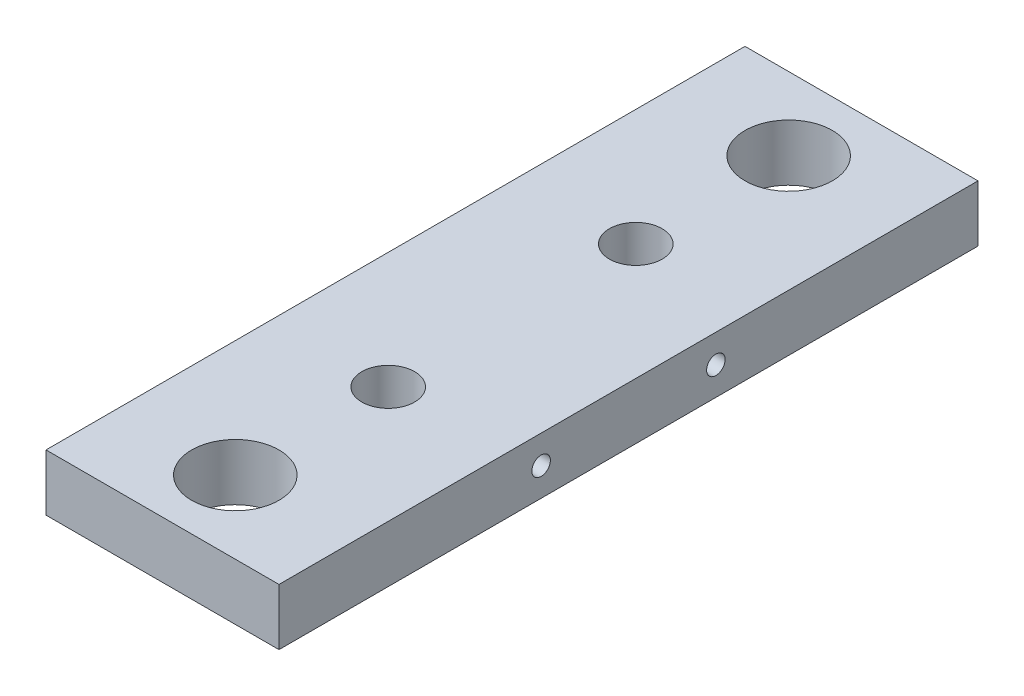
ISO-10303-21;
HEADER;
FILE_DESCRIPTION(('STEP AP214'),'2;1');
FILE_NAME('part.step','',(''),(''),'','','');
FILE_SCHEMA(('AUTOMOTIVE_DESIGN { 1 0 10303 214 1 1 1 1 }'));
ENDSEC;
DATA;
#1=APPLICATION_CONTEXT('core data for automotive mechanical design processes');
#2=APPLICATION_PROTOCOL_DEFINITION('international standard','automotive_design',2000,#1);
#3=PRODUCT_CONTEXT('',#1,'mechanical');
#4=PRODUCT('Part','Part','',(#3));
#5=PRODUCT_RELATED_PRODUCT_CATEGORY('part','',(#4));
#6=PRODUCT_DEFINITION_FORMATION('','',#4);
#7=PRODUCT_DEFINITION_CONTEXT('part definition',#1,'design');
#8=PRODUCT_DEFINITION('design','',#6,#7);
#9=PRODUCT_DEFINITION_SHAPE('','',#8);
#10=(LENGTH_UNIT() NAMED_UNIT(*) SI_UNIT(.MILLI.,.METRE.));
#11=(NAMED_UNIT(*) PLANE_ANGLE_UNIT() SI_UNIT($,.RADIAN.));
#12=(NAMED_UNIT(*) SI_UNIT($,.STERADIAN.) SOLID_ANGLE_UNIT());
#13=UNCERTAINTY_MEASURE_WITH_UNIT(LENGTH_MEASURE(1.E-05),#10,'distance_accuracy_value','');
#14=(GEOMETRIC_REPRESENTATION_CONTEXT(3) GLOBAL_UNCERTAINTY_ASSIGNED_CONTEXT((#13)) GLOBAL_UNIT_ASSIGNED_CONTEXT((#10,
#11,#12)) REPRESENTATION_CONTEXT('',''));
#15=CARTESIAN_POINT('',(0.,0.,0.));
#16=DIRECTION('',(0.,0.,1.));
#17=DIRECTION('',(1.,0.,0.));
#18=AXIS2_PLACEMENT_3D('',#15,#16,#17);
#19=CARTESIAN_POINT('',(-25.4,6.1595,-76.2));
#20=DIRECTION('',(1.,0.,0.));
#21=DIRECTION('',(0.,0.,-1.));
#22=AXIS2_PLACEMENT_3D('',#19,#20,#21);
#23=PLANE('',#22);
#24=CARTESIAN_POINT('',(-25.4,0.,19.05));
#25=DIRECTION('',(-1.,0.,0.));
#26=DIRECTION('',(0.,0.,1.));
#27=AXIS2_PLACEMENT_3D('',#24,#25,#26);
#28=CIRCLE('',#27,2.01929999999999);
#29=CARTESIAN_POINT('',(-25.4,0.,21.0693));
#30=VERTEX_POINT('',#29);
#31=EDGE_CURVE('E107',#30,#30,#28,.T.);
#32=ORIENTED_EDGE('',*,*,#31,.F.);
#33=EDGE_LOOP('',(#32));
#34=FACE_BOUND('',#33,.T.);
#35=CARTESIAN_POINT('',(-25.4,0.,-19.05));
#36=DIRECTION('',(-1.,0.,0.));
#37=DIRECTION('',(0.,0.,1.));
#38=AXIS2_PLACEMENT_3D('',#35,#36,#37);
#39=CIRCLE('',#38,2.01929999999999);
#40=CARTESIAN_POINT('',(-25.4,0.,-17.0307));
#41=VERTEX_POINT('',#40);
#42=EDGE_CURVE('E106',#41,#41,#39,.T.);
#43=ORIENTED_EDGE('',*,*,#42,.F.);
#44=EDGE_LOOP('',(#43));
#45=FACE_BOUND('',#44,.T.);
#46=DIRECTION('',(0.,0.,1.));
#47=VECTOR('',#46,1.);
#48=CARTESIAN_POINT('',(-25.4,-6.1595,-76.2));
#49=LINE('',#48,#47);
#50=CARTESIAN_POINT('',(-25.4,-6.1595,-76.2));
#51=VERTEX_POINT('',#50);
#52=CARTESIAN_POINT('',(-25.4,-6.1595,76.2));
#53=VERTEX_POINT('',#52);
#54=EDGE_CURVE('E153',#51,#53,#49,.T.);
#55=ORIENTED_EDGE('',*,*,#54,.T.);
#56=DIRECTION('',(0.,-1.,0.));
#57=VECTOR('',#56,1.);
#58=CARTESIAN_POINT('',(-25.4,6.1595,76.2));
#59=LINE('',#58,#57);
#60=CARTESIAN_POINT('',(-25.4,6.1595,76.2));
#61=VERTEX_POINT('',#60);
#62=EDGE_CURVE('E11',#61,#53,#59,.T.);
#63=ORIENTED_EDGE('',*,*,#62,.F.);
#64=DIRECTION('',(0.,0.,1.));
#65=VECTOR('',#64,1.);
#66=CARTESIAN_POINT('',(-25.4,6.1595,-76.2));
#67=LINE('',#66,#65);
#68=CARTESIAN_POINT('',(-25.4,6.1595,-76.2));
#69=VERTEX_POINT('',#68);
#70=EDGE_CURVE('E154',#69,#61,#67,.T.);
#71=ORIENTED_EDGE('',*,*,#70,.F.);
#72=DIRECTION('',(0.,-1.,0.));
#73=VECTOR('',#72,1.);
#74=CARTESIAN_POINT('',(-25.4,6.1595,-76.2));
#75=LINE('',#74,#73);
#76=EDGE_CURVE('E160',#69,#51,#75,.T.);
#77=ORIENTED_EDGE('',*,*,#76,.T.);
#78=EDGE_LOOP('',(#55,#63,#71,#77));
#79=FACE_BOUND('',#78,.T.);
#80=ADVANCED_FACE('F36',(#34,#45,#79),#23,.F.);
#81=CARTESIAN_POINT('',(-25.4,6.1595,76.2));
#82=DIRECTION('',(0.,0.,-1.));
#83=DIRECTION('',(-1.,0.,0.));
#84=AXIS2_PLACEMENT_3D('',#81,#82,#83);
#85=PLANE('',#84);
#86=DIRECTION('',(1.,0.,0.));
#87=VECTOR('',#86,1.);
#88=CARTESIAN_POINT('',(-25.4,-6.1595,76.2));
#89=LINE('',#88,#87);
#90=CARTESIAN_POINT('',(25.4,-6.1595,76.2));
#91=VERTEX_POINT('',#90);
#92=EDGE_CURVE('E163',#53,#91,#89,.T.);
#93=ORIENTED_EDGE('',*,*,#92,.T.);
#94=DIRECTION('',(0.,-1.,0.));
#95=VECTOR('',#94,1.);
#96=CARTESIAN_POINT('',(25.4,6.1595,76.2));
#97=LINE('',#96,#95);
#98=CARTESIAN_POINT('',(25.4,6.1595,76.2));
#99=VERTEX_POINT('',#98);
#100=EDGE_CURVE('E44',#99,#91,#97,.T.);
#101=ORIENTED_EDGE('',*,*,#100,.F.);
#102=DIRECTION('',(1.,0.,0.));
#103=VECTOR('',#102,1.);
#104=CARTESIAN_POINT('',(-25.4,6.1595,76.2));
#105=LINE('',#104,#103);
#106=EDGE_CURVE('E83',#61,#99,#105,.T.);
#107=ORIENTED_EDGE('',*,*,#106,.F.);
#108=ORIENTED_EDGE('',*,*,#62,.T.);
#109=EDGE_LOOP('',(#93,#101,#107,#108));
#110=FACE_BOUND('',#109,.T.);
#111=ADVANCED_FACE('F187',(#110),#85,.F.);
#112=CARTESIAN_POINT('',(25.4,6.1595,-76.2));
#113=DIRECTION('',(-1.,0.,0.));
#114=DIRECTION('',(0.,0.,1.));
#115=AXIS2_PLACEMENT_3D('',#112,#113,#114);
#116=PLANE('',#115);
#117=CARTESIAN_POINT('',(25.4,0.,19.05));
#118=DIRECTION('',(1.,0.,0.));
#119=DIRECTION('',(0.,0.,-1.));
#120=AXIS2_PLACEMENT_3D('',#117,#118,#119);
#121=CIRCLE('',#120,2.01929999999999);
#122=CARTESIAN_POINT('',(25.4,0.,17.0307));
#123=VERTEX_POINT('',#122);
#124=EDGE_CURVE('E117',#123,#123,#121,.T.);
#125=ORIENTED_EDGE('',*,*,#124,.F.);
#126=EDGE_LOOP('',(#125));
#127=FACE_BOUND('',#126,.T.);
#128=CARTESIAN_POINT('',(25.4,0.,-19.05));
#129=DIRECTION('',(1.,0.,0.));
#130=DIRECTION('',(0.,0.,-1.));
#131=AXIS2_PLACEMENT_3D('',#128,#129,#130);
#132=CIRCLE('',#131,2.01929999999999);
#133=CARTESIAN_POINT('',(25.4,0.,-21.0693));
#134=VERTEX_POINT('',#133);
#135=EDGE_CURVE('E123',#134,#134,#132,.T.);
#136=ORIENTED_EDGE('',*,*,#135,.F.);
#137=EDGE_LOOP('',(#136));
#138=FACE_BOUND('',#137,.T.);
#139=DIRECTION('',(0.,0.,-1.));
#140=VECTOR('',#139,1.);
#141=CARTESIAN_POINT('',(25.4,-6.1595,-76.2));
#142=LINE('',#141,#140);
#143=CARTESIAN_POINT('',(25.4,-6.1595,-76.2));
#144=VERTEX_POINT('',#143);
#145=EDGE_CURVE('E70',#91,#144,#142,.T.);
#146=ORIENTED_EDGE('',*,*,#145,.T.);
#147=DIRECTION('',(0.,-1.,0.));
#148=VECTOR('',#147,1.);
#149=CARTESIAN_POINT('',(25.4,6.1595,-76.2));
#150=LINE('',#149,#148);
#151=CARTESIAN_POINT('',(25.4,6.1595,-76.2));
#152=VERTEX_POINT('',#151);
#153=EDGE_CURVE('E168',#152,#144,#150,.T.);
#154=ORIENTED_EDGE('',*,*,#153,.F.);
#155=DIRECTION('',(0.,0.,-1.));
#156=VECTOR('',#155,1.);
#157=CARTESIAN_POINT('',(25.4,6.1595,-76.2));
#158=LINE('',#157,#156);
#159=EDGE_CURVE('E157',#99,#152,#158,.T.);
#160=ORIENTED_EDGE('',*,*,#159,.F.);
#161=ORIENTED_EDGE('',*,*,#100,.T.);
#162=EDGE_LOOP('',(#146,#154,#160,#161));
#163=FACE_BOUND('',#162,.T.);
#164=ADVANCED_FACE('F170',(#127,#138,#163),#116,.F.);
#165=CARTESIAN_POINT('',(-25.4,6.1595,-76.2));
#166=DIRECTION('',(0.,0.,1.));
#167=DIRECTION('',(1.,0.,0.));
#168=AXIS2_PLACEMENT_3D('',#165,#166,#167);
#169=PLANE('',#168);
#170=DIRECTION('',(-1.,0.,0.));
#171=VECTOR('',#170,1.);
#172=CARTESIAN_POINT('',(-25.4,-6.1595,-76.2));
#173=LINE('',#172,#171);
#174=EDGE_CURVE('E76',#144,#51,#173,.T.);
#175=ORIENTED_EDGE('',*,*,#174,.T.);
#176=ORIENTED_EDGE('',*,*,#76,.F.);
#177=DIRECTION('',(-1.,0.,0.));
#178=VECTOR('',#177,1.);
#179=CARTESIAN_POINT('',(-25.4,6.1595,-76.2));
#180=LINE('',#179,#178);
#181=EDGE_CURVE('E52',#152,#69,#180,.T.);
#182=ORIENTED_EDGE('',*,*,#181,.F.);
#183=ORIENTED_EDGE('',*,*,#153,.T.);
#184=EDGE_LOOP('',(#175,#176,#182,#183));
#185=FACE_BOUND('',#184,.T.);
#186=ADVANCED_FACE('F177',(#185),#169,.F.);
#187=CARTESIAN_POINT('',(-25.4,6.1595,76.2));
#188=DIRECTION('',(0.,1.,0.));
#189=DIRECTION('',(0.,0.,1.));
#190=AXIS2_PLACEMENT_3D('',#187,#188,#189);
#191=PLANE('',#190);
#192=CARTESIAN_POINT('',(0.,6.1595,-26.9875));
#193=DIRECTION('',(0.,1.,0.));
#194=DIRECTION('',(0.,0.,1.));
#195=AXIS2_PLACEMENT_3D('',#192,#193,#194);
#196=CIRCLE('',#195,5.75437);
#197=CARTESIAN_POINT('',(0.,6.1595,-21.23313));
#198=VERTEX_POINT('',#197);
#199=EDGE_CURVE('E129',#198,#198,#196,.T.);
#200=ORIENTED_EDGE('',*,*,#199,.F.);
#201=EDGE_LOOP('',(#200));
#202=FACE_BOUND('',#201,.T.);
#203=CARTESIAN_POINT('',(0.,6.1595,26.9875));
#204=DIRECTION('',(0.,1.,0.));
#205=DIRECTION('',(0.,0.,1.));
#206=AXIS2_PLACEMENT_3D('',#203,#204,#205);
#207=CIRCLE('',#206,5.75437);
#208=CARTESIAN_POINT('',(0.,6.1595,32.74187));
#209=VERTEX_POINT('',#208);
#210=EDGE_CURVE('E135',#209,#209,#207,.T.);
#211=ORIENTED_EDGE('',*,*,#210,.F.);
#212=EDGE_LOOP('',(#211));
#213=FACE_BOUND('',#212,.T.);
#214=CARTESIAN_POINT('',(0.,6.1595,60.325));
#215=DIRECTION('',(0.,1.,0.));
#216=DIRECTION('',(0.,0.,1.));
#217=AXIS2_PLACEMENT_3D('',#214,#215,#216);
#218=CIRCLE('',#217,9.52500000000002);
#219=CARTESIAN_POINT('',(0.,6.1595,69.85));
#220=VERTEX_POINT('',#219);
#221=EDGE_CURVE('E141',#220,#220,#218,.T.);
#222=ORIENTED_EDGE('',*,*,#221,.F.);
#223=EDGE_LOOP('',(#222));
#224=FACE_BOUND('',#223,.T.);
#225=CARTESIAN_POINT('',(0.,6.1595,-60.325));
#226=DIRECTION('',(0.,1.,0.));
#227=DIRECTION('',(0.,0.,1.));
#228=AXIS2_PLACEMENT_3D('',#225,#226,#227);
#229=CIRCLE('',#228,9.52500000000002);
#230=CARTESIAN_POINT('',(0.,6.1595,-50.8));
#231=VERTEX_POINT('',#230);
#232=EDGE_CURVE('E147',#231,#231,#229,.T.);
#233=ORIENTED_EDGE('',*,*,#232,.F.);
#234=EDGE_LOOP('',(#233));
#235=FACE_BOUND('',#234,.T.);
#236=ORIENTED_EDGE('',*,*,#70,.T.);
#237=ORIENTED_EDGE('',*,*,#106,.T.);
#238=ORIENTED_EDGE('',*,*,#159,.T.);
#239=ORIENTED_EDGE('',*,*,#181,.T.);
#240=EDGE_LOOP('',(#236,#237,#238,#239));
#241=FACE_BOUND('',#240,.T.);
#242=ADVANCED_FACE('F179',(#202,#213,#224,#235,#241),#191,.T.);
#243=CARTESIAN_POINT('',(-25.4,-6.1595,76.2));
#244=DIRECTION('',(0.,1.,0.));
#245=DIRECTION('',(0.,0.,1.));
#246=AXIS2_PLACEMENT_3D('',#243,#244,#245);
#247=PLANE('',#246);
#248=CARTESIAN_POINT('',(0.,-6.1595,-26.9875));
#249=DIRECTION('',(0.,1.,0.));
#250=DIRECTION('',(0.,0.,1.));
#251=AXIS2_PLACEMENT_3D('',#248,#249,#250);
#252=CIRCLE('',#251,5.75437);
#253=CARTESIAN_POINT('',(0.,-6.1595,-21.23313));
#254=VERTEX_POINT('',#253);
#255=EDGE_CURVE('E132',#254,#254,#252,.T.);
#256=ORIENTED_EDGE('',*,*,#255,.T.);
#257=EDGE_LOOP('',(#256));
#258=FACE_BOUND('',#257,.T.);
#259=CARTESIAN_POINT('',(0.,-6.1595,26.9875));
#260=DIRECTION('',(0.,1.,0.));
#261=DIRECTION('',(0.,0.,1.));
#262=AXIS2_PLACEMENT_3D('',#259,#260,#261);
#263=CIRCLE('',#262,5.75437);
#264=CARTESIAN_POINT('',(0.,-6.1595,32.74187));
#265=VERTEX_POINT('',#264);
#266=EDGE_CURVE('E138',#265,#265,#263,.T.);
#267=ORIENTED_EDGE('',*,*,#266,.T.);
#268=EDGE_LOOP('',(#267));
#269=FACE_BOUND('',#268,.T.);
#270=CARTESIAN_POINT('',(0.,-6.1595,60.325));
#271=DIRECTION('',(0.,1.,0.));
#272=DIRECTION('',(0.,0.,1.));
#273=AXIS2_PLACEMENT_3D('',#270,#271,#272);
#274=CIRCLE('',#273,9.52500000000002);
#275=CARTESIAN_POINT('',(0.,-6.1595,69.85));
#276=VERTEX_POINT('',#275);
#277=EDGE_CURVE('E144',#276,#276,#274,.F.);
#278=ORIENTED_EDGE('',*,*,#277,.F.);
#279=EDGE_LOOP('',(#278));
#280=FACE_BOUND('',#279,.T.);
#281=CARTESIAN_POINT('',(0.,-6.1595,-60.325));
#282=DIRECTION('',(0.,1.,0.));
#283=DIRECTION('',(0.,0.,1.));
#284=AXIS2_PLACEMENT_3D('',#281,#282,#283);
#285=CIRCLE('',#284,9.52500000000002);
#286=CARTESIAN_POINT('',(0.,-6.1595,-50.8));
#287=VERTEX_POINT('',#286);
#288=EDGE_CURVE('E150',#287,#287,#285,.F.);
#289=ORIENTED_EDGE('',*,*,#288,.F.);
#290=EDGE_LOOP('',(#289));
#291=FACE_BOUND('',#290,.T.);
#292=ORIENTED_EDGE('',*,*,#54,.F.);
#293=ORIENTED_EDGE('',*,*,#174,.F.);
#294=ORIENTED_EDGE('',*,*,#145,.F.);
#295=ORIENTED_EDGE('',*,*,#92,.F.);
#296=EDGE_LOOP('',(#292,#293,#294,#295));
#297=FACE_BOUND('',#296,.T.);
#298=ADVANCED_FACE('F173',(#258,#269,#280,#291,#297),#247,.F.);
#299=CARTESIAN_POINT('',(0.,-6.1605,-60.325));
#300=DIRECTION('',(0.,1.,0.));
#301=DIRECTION('',(0.,0.,1.));
#302=AXIS2_PLACEMENT_3D('',#299,#300,#301);
#303=CYLINDRICAL_SURFACE('',#302,9.52500000000002);
#304=ORIENTED_EDGE('',*,*,#232,.T.);
#305=EDGE_LOOP('',(#304));
#306=FACE_BOUND('',#305,.T.);
#307=ORIENTED_EDGE('',*,*,#288,.T.);
#308=EDGE_LOOP('',(#307));
#309=FACE_BOUND('',#308,.T.);
#310=ADVANCED_FACE('F239',(#306,#309),#303,.F.);
#311=CARTESIAN_POINT('',(0.,-6.1605,60.325));
#312=DIRECTION('',(0.,1.,0.));
#313=DIRECTION('',(0.,0.,1.));
#314=AXIS2_PLACEMENT_3D('',#311,#312,#313);
#315=CYLINDRICAL_SURFACE('',#314,9.52500000000002);
#316=ORIENTED_EDGE('',*,*,#221,.T.);
#317=EDGE_LOOP('',(#316));
#318=FACE_BOUND('',#317,.T.);
#319=ORIENTED_EDGE('',*,*,#277,.T.);
#320=EDGE_LOOP('',(#319));
#321=FACE_BOUND('',#320,.T.);
#322=ADVANCED_FACE('F235',(#318,#321),#315,.F.);
#323=CARTESIAN_POINT('',(0.,6.1595,26.9875));
#324=DIRECTION('',(0.,1.,0.));
#325=DIRECTION('',(0.,0.,1.));
#326=AXIS2_PLACEMENT_3D('',#323,#324,#325);
#327=CYLINDRICAL_SURFACE('',#326,5.75437);
#328=ORIENTED_EDGE('',*,*,#266,.F.);
#329=EDGE_LOOP('',(#328));
#330=FACE_BOUND('',#329,.T.);
#331=ORIENTED_EDGE('',*,*,#210,.T.);
#332=EDGE_LOOP('',(#331));
#333=FACE_BOUND('',#332,.T.);
#334=ADVANCED_FACE('F231',(#330,#333),#327,.F.);
#335=CARTESIAN_POINT('',(0.,6.1595,-26.9875));
#336=DIRECTION('',(0.,1.,0.));
#337=DIRECTION('',(0.,0.,1.));
#338=AXIS2_PLACEMENT_3D('',#335,#336,#337);
#339=CYLINDRICAL_SURFACE('',#338,5.75437);
#340=ORIENTED_EDGE('',*,*,#255,.F.);
#341=EDGE_LOOP('',(#340));
#342=FACE_BOUND('',#341,.T.);
#343=ORIENTED_EDGE('',*,*,#199,.T.);
#344=EDGE_LOOP('',(#343));
#345=FACE_BOUND('',#344,.T.);
#346=ADVANCED_FACE('F227',(#342,#345),#339,.F.);
#347=CARTESIAN_POINT('',(11.7856,0.,-19.05));
#348=DIRECTION('',(1.,0.,0.));
#349=DIRECTION('',(0.,0.,-1.));
#350=AXIS2_PLACEMENT_3D('',#347,#348,#349);
#351=CONICAL_SURFACE('',#350,2.01929999999999,1.02974425867665);
#352=CARTESIAN_POINT('',(10.5722821519976,0.,-19.05));
#353=VERTEX_POINT('',#352);
#354=VERTEX_LOOP('',#353);
#355=FACE_BOUND('',#354,.T.);
#356=CARTESIAN_POINT('',(11.7856,0.,-19.05));
#357=DIRECTION('',(1.,0.,0.));
#358=DIRECTION('',(0.,0.,-1.));
#359=AXIS2_PLACEMENT_3D('',#356,#357,#358);
#360=CIRCLE('',#359,2.01929999999999);
#361=CARTESIAN_POINT('',(11.7856,0.,-21.0693));
#362=VERTEX_POINT('',#361);
#363=EDGE_CURVE('E126',#362,#362,#360,.T.);
#364=ORIENTED_EDGE('',*,*,#363,.T.);
#365=EDGE_LOOP('',(#364));
#366=FACE_BOUND('',#365,.T.);
#367=ADVANCED_FACE('F223',(#355,#366),#351,.F.);
#368=CARTESIAN_POINT('',(25.4,0.,-19.05));
#369=DIRECTION('',(1.,0.,0.));
#370=DIRECTION('',(0.,0.,-1.));
#371=AXIS2_PLACEMENT_3D('',#368,#369,#370);
#372=CYLINDRICAL_SURFACE('',#371,2.01929999999999);
#373=ORIENTED_EDGE('',*,*,#363,.F.);
#374=EDGE_LOOP('',(#373));
#375=FACE_BOUND('',#374,.T.);
#376=ORIENTED_EDGE('',*,*,#135,.T.);
#377=EDGE_LOOP('',(#376));
#378=FACE_BOUND('',#377,.T.);
#379=ADVANCED_FACE('F219',(#375,#378),#372,.F.);
#380=CARTESIAN_POINT('',(11.7856,0.,19.05));
#381=DIRECTION('',(1.,0.,0.));
#382=DIRECTION('',(0.,0.,-1.));
#383=AXIS2_PLACEMENT_3D('',#380,#381,#382);
#384=CONICAL_SURFACE('',#383,2.01929999999999,1.02974425867665);
#385=CARTESIAN_POINT('',(10.5722821519976,0.,19.05));
#386=VERTEX_POINT('',#385);
#387=VERTEX_LOOP('',#386);
#388=FACE_BOUND('',#387,.T.);
#389=CARTESIAN_POINT('',(11.7856,0.,19.05));
#390=DIRECTION('',(1.,0.,0.));
#391=DIRECTION('',(0.,0.,-1.));
#392=AXIS2_PLACEMENT_3D('',#389,#390,#391);
#393=CIRCLE('',#392,2.01929999999999);
#394=CARTESIAN_POINT('',(11.7856,0.,17.0307));
#395=VERTEX_POINT('',#394);
#396=EDGE_CURVE('E120',#395,#395,#393,.T.);
#397=ORIENTED_EDGE('',*,*,#396,.T.);
#398=EDGE_LOOP('',(#397));
#399=FACE_BOUND('',#398,.T.);
#400=ADVANCED_FACE('F215',(#388,#399),#384,.F.);
#401=CARTESIAN_POINT('',(25.4,0.,19.05));
#402=DIRECTION('',(1.,0.,0.));
#403=DIRECTION('',(0.,0.,-1.));
#404=AXIS2_PLACEMENT_3D('',#401,#402,#403);
#405=CYLINDRICAL_SURFACE('',#404,2.01929999999999);
#406=ORIENTED_EDGE('',*,*,#396,.F.);
#407=EDGE_LOOP('',(#406));
#408=FACE_BOUND('',#407,.T.);
#409=ORIENTED_EDGE('',*,*,#124,.T.);
#410=EDGE_LOOP('',(#409));
#411=FACE_BOUND('',#410,.T.);
#412=ADVANCED_FACE('F207',(#408,#411),#405,.F.);
#413=CARTESIAN_POINT('',(-11.7856,0.,-19.05));
#414=DIRECTION('',(-1.,0.,0.));
#415=DIRECTION('',(0.,0.,1.));
#416=AXIS2_PLACEMENT_3D('',#413,#414,#415);
#417=CONICAL_SURFACE('',#416,2.01929999999999,1.02974425867665);
#418=CARTESIAN_POINT('',(-10.5722821519976,0.,-19.05));
#419=VERTEX_POINT('',#418);
#420=VERTEX_LOOP('',#419);
#421=FACE_BOUND('',#420,.T.);
#422=CARTESIAN_POINT('',(-11.7856,0.,-19.05));
#423=DIRECTION('',(-1.,0.,0.));
#424=DIRECTION('',(0.,0.,1.));
#425=AXIS2_PLACEMENT_3D('',#422,#423,#424);
#426=CIRCLE('',#425,2.01929999999999);
#427=CARTESIAN_POINT('',(-11.7856,0.,-17.0307));
#428=VERTEX_POINT('',#427);
#429=EDGE_CURVE('E110',#428,#428,#426,.T.);
#430=ORIENTED_EDGE('',*,*,#429,.T.);
#431=EDGE_LOOP('',(#430));
#432=FACE_BOUND('',#431,.T.);
#433=ADVANCED_FACE('F201',(#421,#432),#417,.F.);
#434=CARTESIAN_POINT('',(-25.4,0.,-19.05));
#435=DIRECTION('',(-1.,0.,0.));
#436=DIRECTION('',(0.,0.,1.));
#437=AXIS2_PLACEMENT_3D('',#434,#435,#436);
#438=CYLINDRICAL_SURFACE('',#437,2.01929999999999);
#439=ORIENTED_EDGE('',*,*,#429,.F.);
#440=EDGE_LOOP('',(#439));
#441=FACE_BOUND('',#440,.T.);
#442=ORIENTED_EDGE('',*,*,#42,.T.);
#443=EDGE_LOOP('',(#442));
#444=FACE_BOUND('',#443,.T.);
#445=ADVANCED_FACE('F100',(#441,#444),#438,.F.);
#446=CARTESIAN_POINT('',(-11.7856,0.,19.05));
#447=DIRECTION('',(-1.,0.,0.));
#448=DIRECTION('',(0.,0.,1.));
#449=AXIS2_PLACEMENT_3D('',#446,#447,#448);
#450=CONICAL_SURFACE('',#449,2.01929999999999,1.02974425867665);
#451=CARTESIAN_POINT('',(-10.5722821519976,0.,19.05));
#452=VERTEX_POINT('',#451);
#453=VERTEX_LOOP('',#452);
#454=FACE_BOUND('',#453,.T.);
#455=CARTESIAN_POINT('',(-11.7856,0.,19.05));
#456=DIRECTION('',(-1.,0.,0.));
#457=DIRECTION('',(0.,0.,1.));
#458=AXIS2_PLACEMENT_3D('',#455,#456,#457);
#459=CIRCLE('',#458,2.01929999999999);
#460=CARTESIAN_POINT('',(-11.7856,0.,21.0693));
#461=VERTEX_POINT('',#460);
#462=EDGE_CURVE('E104',#461,#461,#459,.T.);
#463=ORIENTED_EDGE('',*,*,#462,.T.);
#464=EDGE_LOOP('',(#463));
#465=FACE_BOUND('',#464,.T.);
#466=ADVANCED_FACE('F96',(#454,#465),#450,.F.);
#467=CARTESIAN_POINT('',(-25.4,0.,19.05));
#468=DIRECTION('',(-1.,0.,0.));
#469=DIRECTION('',(0.,0.,1.));
#470=AXIS2_PLACEMENT_3D('',#467,#468,#469);
#471=CYLINDRICAL_SURFACE('',#470,2.01929999999999);
#472=ORIENTED_EDGE('',*,*,#462,.F.);
#473=EDGE_LOOP('',(#472));
#474=FACE_BOUND('',#473,.T.);
#475=ORIENTED_EDGE('',*,*,#31,.T.);
#476=EDGE_LOOP('',(#475));
#477=FACE_BOUND('',#476,.T.);
#478=ADVANCED_FACE('F99',(#474,#477),#471,.F.);
#479=CLOSED_SHELL('',(#80,#111,#164,#186,#242,#298,#310,#322,#334,#346,#367,#379,#400,#412,#433,
#445,#466,#478));
#480=MANIFOLD_SOLID_BREP('B2',#479);
#481=ADVANCED_BREP_SHAPE_REPRESENTATION('',(#18,#480),#14);
#482=SHAPE_DEFINITION_REPRESENTATION(#9,#481);
ENDSEC;
END-ISO-10303-21;
